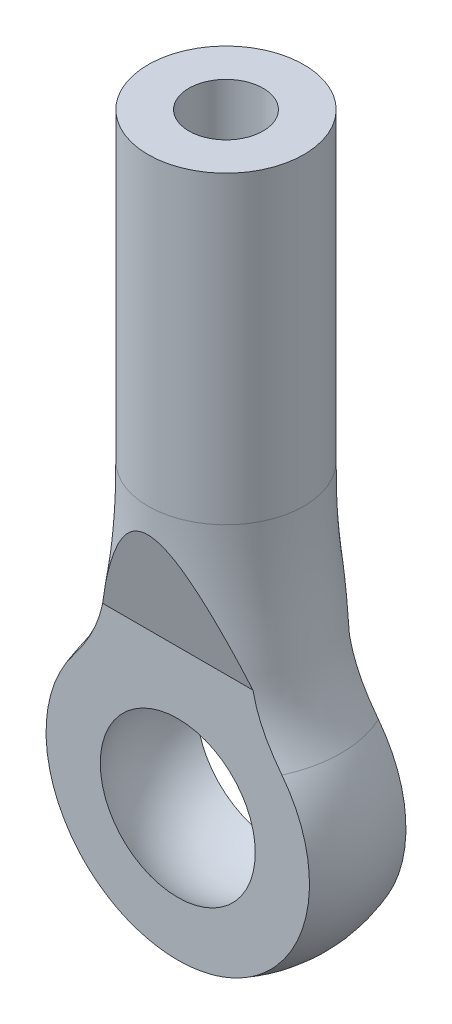
ISO-10303-21;
HEADER;
FILE_DESCRIPTION(('STEP AP214'),'2;1');
FILE_NAME('part.step','',(''),(''),'','','');
FILE_SCHEMA(('AUTOMOTIVE_DESIGN { 1 0 10303 214 1 1 1 1 }'));
ENDSEC;
DATA;
#1=APPLICATION_CONTEXT('core data for automotive mechanical design processes');
#2=APPLICATION_PROTOCOL_DEFINITION('international standard','automotive_design',2000,#1);
#3=PRODUCT_CONTEXT('',#1,'mechanical');
#4=PRODUCT('Part','Part','',(#3));
#5=PRODUCT_RELATED_PRODUCT_CATEGORY('part','',(#4));
#6=PRODUCT_DEFINITION_FORMATION('','',#4);
#7=PRODUCT_DEFINITION_CONTEXT('part definition',#1,'design');
#8=PRODUCT_DEFINITION('design','',#6,#7);
#9=PRODUCT_DEFINITION_SHAPE('','',#8);
#10=(LENGTH_UNIT() NAMED_UNIT(*) SI_UNIT(.MILLI.,.METRE.));
#11=(NAMED_UNIT(*) PLANE_ANGLE_UNIT() SI_UNIT($,.RADIAN.));
#12=(NAMED_UNIT(*) SI_UNIT($,.STERADIAN.) SOLID_ANGLE_UNIT());
#13=UNCERTAINTY_MEASURE_WITH_UNIT(LENGTH_MEASURE(1.E-05),#10,'distance_accuracy_value','');
#14=(GEOMETRIC_REPRESENTATION_CONTEXT(3) GLOBAL_UNCERTAINTY_ASSIGNED_CONTEXT((#13)) GLOBAL_UNIT_ASSIGNED_CONTEXT((#10,
#11,#12)) REPRESENTATION_CONTEXT('',''));
#15=CARTESIAN_POINT('',(0.,0.,0.));
#16=DIRECTION('',(0.,0.,1.));
#17=DIRECTION('',(1.,0.,0.));
#18=AXIS2_PLACEMENT_3D('',#15,#16,#17);
#19=CARTESIAN_POINT('',(-2.1,7.44362624703913,0.));
#20=CARTESIAN_POINT('',(-2.1,6.03895656151775,0.));
#21=CARTESIAN_POINT('',(-2.21604973445166,5.07485484049602,0.));
#22=CARTESIAN_POINT('',(-2.40518566332008,3.74266654853741,0.));
#23=CARTESIAN_POINT('',(-2.50704085467722,3.0077986124755,0.));
#24=CARTESIAN_POINT('',(-3.09395736948081,2.17159567964097,0.));
#25=B_SPLINE_CURVE_WITH_KNOTS('',3,(#19,#20,#21,#22,#23,#24),.UNSPECIFIED.,.F.,.F.,(4,1,1,4),
(0.,0.498932295994101,0.598932295994101,1.),.UNSPECIFIED.);
#26=CARTESIAN_POINT('',(0.,15.65,0.));
#27=DIRECTION('',(0.,1.,0.));
#28=AXIS1_PLACEMENT('',#26,#27);
#29=SURFACE_OF_REVOLUTION('',#25,#28);
#30=CARTESIAN_POINT('',(0.,7.44362624703913,0.));
#31=DIRECTION('',(0.,1.,0.));
#32=DIRECTION('',(0.,0.,1.));
#33=AXIS2_PLACEMENT_3D('',#30,#31,#32);
#34=CIRCLE('',#33,2.1);
#35=CARTESIAN_POINT('',(0.,7.44362624703913,2.1));
#36=VERTEX_POINT('',#35);
#37=EDGE_CURVE('E151',#36,#36,#34,.T.);
#38=ORIENTED_EDGE('',*,*,#37,.F.);
#39=EDGE_LOOP('',(#38));
#40=FACE_BOUND('',#39,.T.);
#41=CARTESIAN_POINT('',(0.,2.17159567964098,0.));
#42=DIRECTION('',(0.,1.,0.));
#43=DIRECTION('',(0.,0.,1.));
#44=AXIS2_PLACEMENT_3D('',#41,#42,#43);
#45=CIRCLE('',#44,3.09395736948081);
#46=CARTESIAN_POINT('',(-2.80759188703854,2.17159567964098,-1.3));
#47=VERTEX_POINT('',#46);
#48=CARTESIAN_POINT('',(-2.80759188703854,2.17159567964098,1.3));
#49=VERTEX_POINT('',#48);
#50=EDGE_CURVE('E154',#47,#49,#45,.T.);
#51=ORIENTED_EDGE('',*,*,#50,.T.);
#52=CARTESIAN_POINT('',(-2.80759188703854,2.17159567964098,1.3));
#53=CARTESIAN_POINT('',(-2.76603533605479,2.22533616025869,1.3));
#54=CARTESIAN_POINT('',(-2.72529979378871,2.27972817876255,1.3));
#55=CARTESIAN_POINT('',(-2.6456773743171,2.39011987369264,1.3));
#56=CARTESIAN_POINT('',(-2.60679704982379,2.44612426807639,1.3));
#57=CARTESIAN_POINT('',(-2.53132956017229,2.55975394060671,1.3));
#58=CARTESIAN_POINT('',(-2.49474495036664,2.61738092503684,1.3));
#59=CARTESIAN_POINT('',(-2.4250396978784,2.73313145961409,1.3));
#60=CARTESIAN_POINT('',(-2.39186433165014,2.79122191818886,1.3));
#61=CARTESIAN_POINT('',(-2.32862780461938,2.90900119058871,1.3));
#62=CARTESIAN_POINT('',(-2.29856335810376,2.96868823247929,1.3));
#63=CARTESIAN_POINT('',(-2.24196229258089,3.08966081644976,1.3));
#64=CARTESIAN_POINT('',(-2.21542270920483,3.15094496282242,1.3));
#65=CARTESIAN_POINT('',(-2.17315408831546,3.25744995847942,1.3));
#66=CARTESIAN_POINT('',(-2.15649252115793,3.30230267520206,1.3));
#67=CARTESIAN_POINT('',(-2.12518136700518,3.3927169290331,1.3));
#68=CARTESIAN_POINT('',(-2.11053220289284,3.43827861289012,1.3));
#69=CARTESIAN_POINT('',(-2.08308794129852,3.53042773208204,1.3));
#70=CARTESIAN_POINT('',(-2.07031191492834,3.57702081008995,1.3));
#71=CARTESIAN_POINT('',(-2.0465810806341,3.6706532046618,1.3));
#72=CARTESIAN_POINT('',(-2.03562565674347,3.71769236458535,1.3));
#73=CARTESIAN_POINT('',(-2.02547550880759,3.76489429954603,1.3));
#74=B_SPLINE_CURVE_WITH_KNOTS('',3,(#52,#53,#54,#55,#56,#57,#58,#59,#60,#61,#62,#63,#64,#65,#66,
#67,#68,#69,#70,#71,#72,#73),.UNSPECIFIED.,.F.,.F.,(4,2,2,2,2,2,2,2,2,2,4),(0.,0.20381267538736,
0.408298751387244,0.613008543998019,0.813616148873261,1.01400966418937,1.21423356911049,
1.35773117631759,1.50125889188708,1.64615922973658,1.79101044303401),.UNSPECIFIED.);
#75=CARTESIAN_POINT('',(-2.02547550880761,3.76489429954604,1.3));
#76=VERTEX_POINT('',#75);
#77=EDGE_CURVE('E57',#49,#76,#74,.T.);
#78=ORIENTED_EDGE('',*,*,#77,.T.);
#79=CARTESIAN_POINT('',(-2.02547550880761,3.76489429954604,1.29999999999998));
#80=CARTESIAN_POINT('',(-2.01472919938393,3.79260971726178,1.30742632379482));
#81=CARTESIAN_POINT('',(-2.00413980048052,3.82038093682993,1.31486759965094));
#82=CARTESIAN_POINT('',(-1.98317438046031,3.8759973201883,1.32976996465775));
#83=CARTESIAN_POINT('',(-1.97279835095873,3.90384248102412,1.33723105301682));
#84=CARTESIAN_POINT('',(-1.95215687729029,3.95957537664327,1.35216463738982));
#85=CARTESIAN_POINT('',(-1.94189144962382,3.98746311708937,1.35963713492108));
#86=CARTESIAN_POINT('',(-1.9213545595363,4.04323675593076,1.37458163640758));
#87=CARTESIAN_POINT('',(-1.91108309708143,4.07112265431473,1.38205364035978));
#88=CARTESIAN_POINT('',(-1.89036325468646,4.12689372178887,1.3969974528505));
#89=CARTESIAN_POINT('',(-1.8799145730759,4.15477878679496,1.40446923349977));
#90=CARTESIAN_POINT('',(-1.85878795126981,4.21046766305372,1.4193910229207));
#91=CARTESIAN_POINT('',(-1.84811001175048,4.23827147454576,1.4268410317565));
#92=CARTESIAN_POINT('',(-1.81576202927882,4.32156459295434,1.44915935556915));
#93=CARTESIAN_POINT('',(-1.79377626258534,4.37693978631886,1.46399709391189));
#94=CARTESIAN_POINT('',(-1.74895532077457,4.48741660569936,1.49359926844725));
#95=CARTESIAN_POINT('',(-1.72611951718857,4.54251799373899,1.5083636408743));
#96=CARTESIAN_POINT('',(-1.67964000091849,4.65240426500099,1.53780757851822));
#97=CARTESIAN_POINT('',(-1.65599624937497,4.70718913285128,1.55248713961615));
#98=CARTESIAN_POINT('',(-1.58397129317403,4.87108612530912,1.59640320638712));
#99=CARTESIAN_POINT('',(-1.53449229236371,4.97975066972032,1.62551978330799));
#100=CARTESIAN_POINT('',(-1.43252891195563,5.19569180891984,1.68338103716917));
#101=CARTESIAN_POINT('',(-1.38004600431121,5.30296905243961,1.71212588793654));
#102=CARTESIAN_POINT('',(-1.2712175619567,5.5156388630616,1.76911059194714));
#103=CARTESIAN_POINT('',(-1.21487417141438,5.62103243601789,1.79735071470815));
#104=CARTESIAN_POINT('',(-1.13438796583178,5.76247074435472,1.83524899520587));
#105=CARTESIAN_POINT('',(-1.11266980176968,5.79980379414049,1.84525235574699));
#106=CARTESIAN_POINT('',(-1.06838141887941,5.8739980627223,1.86513265009651));
#107=CARTESIAN_POINT('',(-1.04581118113883,5.91085927102112,1.87500958109221));
#108=CARTESIAN_POINT('',(-0.999615783694389,5.984112332268,1.89463767969642));
#109=CARTESIAN_POINT('',(-0.975987680973321,6.02050245935769,1.90438838486257));
#110=CARTESIAN_POINT('',(-0.927571293651027,6.09255589301128,1.92369504422194));
#111=CARTESIAN_POINT('',(-0.902783054023135,6.12821922767287,1.93325100594391));
#112=CARTESIAN_POINT('',(-0.849000417840321,6.20255496400817,1.95316920646372));
#113=CARTESIAN_POINT('',(-0.819845194940028,6.24111955144347,1.96350255652345));
#114=CARTESIAN_POINT('',(-0.759505698485368,6.31673547258002,1.98376378152693));
#115=CARTESIAN_POINT('',(-0.728321940479127,6.35378718690872,1.99369175845949));
#116=CARTESIAN_POINT('',(-0.663597997804945,6.4257090996818,2.01296317690514));
#117=CARTESIAN_POINT('',(-0.630066539161551,6.46058655152825,2.02230856196147));
#118=CARTESIAN_POINT('',(-0.560063019663715,6.52743975271063,2.04022182322969));
#119=CARTESIAN_POINT('',(-0.523594522768085,6.55941892169286,2.04879061573305));
#120=CARTESIAN_POINT('',(-0.452377700213506,6.61511364433955,2.06371397168891));
#121=CARTESIAN_POINT('',(-0.418081541483814,6.63936088926314,2.0702110013849));
#122=CARTESIAN_POINT('',(-0.34655108999227,6.6835431769631,2.0820496096939));
#123=CARTESIAN_POINT('',(-0.309315897607924,6.70347689235065,2.08739083263414));
#124=CARTESIAN_POINT('',(-0.23137486960084,6.73761479520915,2.09653805613635));
#125=CARTESIAN_POINT('',(-0.190626085600232,6.75173051472743,2.10032035178186));
#126=CARTESIAN_POINT('',(-0.1070634500384,6.77186159678394,2.10571445896167));
#127=CARTESIAN_POINT('',(-0.0642558448598268,6.77790003524048,2.10733245366965));
#128=CARTESIAN_POINT('',(0.0161050003784142,6.7806820015555,2.10807787929712));
#129=CARTESIAN_POINT('',(0.0536191598586208,6.77853010531929,2.10750128043844));
#130=CARTESIAN_POINT('',(0.127631833235744,6.76766260810308,2.10458934333561));
#131=CARTESIAN_POINT('',(0.16412882564231,6.75893766979107,2.10225150316089));
#132=CARTESIAN_POINT('',(0.243975046234401,6.73311629949848,2.09533268784353));
#133=CARTESIAN_POINT('',(0.286779089150887,6.71448041726543,2.09033921824894));
#134=CARTESIAN_POINT('',(0.368824735251603,6.67100159350336,2.07868910253404));
#135=CARTESIAN_POINT('',(0.408059289441349,6.64614671865215,2.07202925888968));
#136=CARTESIAN_POINT('',(0.480121149795293,6.59434220616367,2.0581482816041));
#137=CARTESIAN_POINT('',(0.513210016595784,6.56772440209631,2.05101606249997));
#138=CARTESIAN_POINT('',(0.576943580728,6.51186153796875,2.0360476531701));
#139=CARTESIAN_POINT('',(0.607585918901388,6.48261399850005,2.02821079858886));
#140=CARTESIAN_POINT('',(0.666867347354748,6.42211037388877,2.01199890123512));
#141=CARTESIAN_POINT('',(0.695499166167031,6.39084771101949,2.00362209596605));
#142=CARTESIAN_POINT('',(0.750959833340318,6.32690348068237,1.98648829108658));
#143=CARTESIAN_POINT('',(0.777789614098387,6.29422266162211,1.9777314920114));
#144=CARTESIAN_POINT('',(0.836950294963602,6.21883583032201,1.95753165144459));
#145=CARTESIAN_POINT('',(0.868822548919816,6.17579533593933,1.94599898573292));
#146=CARTESIAN_POINT('',(0.9306002236605,6.08841122706606,1.92258448432902));
#147=CARTESIAN_POINT('',(0.960505074184557,6.04406724009419,1.91070254883073));
#148=CARTESIAN_POINT('',(1.04792805577868,5.90940214357182,1.8746191449689));
#149=CARTESIAN_POINT('',(1.10302615440085,5.81761838690391,1.85002576149144));
#150=CARTESIAN_POINT('',(1.20883467020701,5.63160992400622,1.80018494407265));
#151=CARTESIAN_POINT('',(1.25953905432139,5.5373820852829,1.77493667078221));
#152=CARTESIAN_POINT('',(1.35789151614781,5.34702457494129,1.72393052961297));
#153=CARTESIAN_POINT('',(1.40552768264547,5.25088918863501,1.69817113048815));
#154=CARTESIAN_POINT('',(1.49817697683666,5.05763522171307,1.64638888611732));
#155=CARTESIAN_POINT('',(1.5431940789308,4.96051840799946,1.62036651431129));
#156=CARTESIAN_POINT('',(1.6309012805981,4.76535878356269,1.56807365054825));
#157=CARTESIAN_POINT('',(1.67359241769767,4.66731640897886,1.54180327545442));
#158=CARTESIAN_POINT('',(1.74290763493185,4.50224791069276,1.49757330464287));
#159=CARTESIAN_POINT('',(1.77024328484287,4.43549995388593,1.4796882435201));
#160=CARTESIAN_POINT('',(1.82372028796729,4.30153200034363,1.44379163855682));
#161=CARTESIAN_POINT('',(1.84986124548686,4.23431185559849,1.42578005505725));
#162=CARTESIAN_POINT('',(1.90058328731816,4.09992818493776,1.38977205902776));
#163=CARTESIAN_POINT('',(1.92517504062805,4.03276838721359,1.37177664546374));
#164=CARTESIAN_POINT('',(1.9746725514105,3.89858844070454,1.33582323715619));
#165=CARTESIAN_POINT('',(1.99957817971307,3.83156824690008,1.31786523034972));
#166=CARTESIAN_POINT('',(2.02547550880759,3.76489429954604,1.3));
#167=B_SPLINE_CURVE_WITH_KNOTS('',3,(#79,#80,#81,#82,#83,#84,#85,#86,#87,#88,#89,#90,#91,#92,
#93,#94,#95,#96,#97,#98,#99,#100,#101,#102,#103,#104,#105,#106,#107,#108,#109,#110,#111,#112,
#113,#114,#115,#116,#117,#118,#119,#120,#121,#122,#123,#124,#125,#126,#127,#128,#129,#130,#131,
#132,#133,#134,#135,#136,#137,#138,#139,#140,#141,#142,#143,#144,#145,#146,#147,#148,#149,#150,
#151,#152,#153,#154,#155,#156,#157,#158,#159,#160,#161,#162,#163,#164,#165,#166),.UNSPECIFIED.,
.F.,.F.,(4,2,2,2,2,2,2,2,2,2,2,2,2,2,2,2,2,2,2,2,2,2,2,2,2,2,2,2,2,2,2,2,2,2,2,2,2,2,2,2,2,2,2,
4),(0.,0.0919166970375345,0.183829775097579,0.275756380676258,0.367683506338222,
0.459787034206494,0.551890290450065,0.736082938542771,0.920414583889697,1.10475510745127,
1.47340267610138,1.84187112398768,2.21013655267782,2.3431300699895,2.47612654092702,
2.60951930991821,2.74290691214304,2.89116587528165,3.03938730481079,3.18708440479408,
3.33460490624588,3.46185540741237,3.58914501146276,3.71830449112005,3.84709418236243,
3.95916976561301,4.07140485869722,4.21147254606894,4.35181109179894,4.48080320690777,
4.60991824189319,4.73947846384392,4.86897112490679,5.03325403539985,5.19758435609735,
5.52689825704362,5.85665740564653,6.18762788960256,6.51808227529194,6.84838803003464,
7.07131692943085,7.29431913774933,7.5155640101121,7.73672062744916),.UNSPECIFIED.);
#168=CARTESIAN_POINT('',(2.0254755088076,3.76489429954604,1.3));
#169=VERTEX_POINT('',#168);
#170=EDGE_CURVE('E11',#76,#169,#167,.T.);
#171=ORIENTED_EDGE('',*,*,#170,.T.);
#172=CARTESIAN_POINT('',(2.0254755088076,3.76489429954604,1.3));
#173=CARTESIAN_POINT('',(2.03285741030641,3.7306319224151,1.3));
#174=CARTESIAN_POINT('',(2.04064698579813,3.69645655447712,1.3));
#175=CARTESIAN_POINT('',(2.0571482940166,3.62832406137667,1.3));
#176=CARTESIAN_POINT('',(2.06586017047194,3.59436697110711,1.3));
#177=CARTESIAN_POINT('',(2.09349667205432,3.493049273447,1.3));
#178=CARTESIAN_POINT('',(2.11395266877168,3.42609613445667,1.3));
#179=CARTESIAN_POINT('',(2.15918622556807,3.29373239597974,1.3));
#180=CARTESIAN_POINT('',(2.18396002079511,3.22832050856196,1.3));
#181=CARTESIAN_POINT('',(2.23720243780141,3.10025717369021,1.3));
#182=CARTESIAN_POINT('',(2.26560515853897,3.0375782396286,1.3));
#183=CARTESIAN_POINT('',(2.32600534084087,2.91395874258736,1.3));
#184=CARTESIAN_POINT('',(2.35800407463154,2.85301880446538,1.3));
#185=CARTESIAN_POINT('',(2.42510805104454,2.73288873572571,1.3));
#186=CARTESIAN_POINT('',(2.46021299648867,2.67369843843726,1.3));
#187=CARTESIAN_POINT('',(2.52047769739118,2.57715678534395,1.3));
#188=CARTESIAN_POINT('',(2.54488060843219,2.53932886114266,1.3));
#189=CARTESIAN_POINT('',(2.59469872267371,2.46436265811927,1.3));
#190=CARTESIAN_POINT('',(2.62011360306784,2.42722416483222,1.3));
#191=CARTESIAN_POINT('',(2.67205187698599,2.35331319065545,1.3));
#192=CARTESIAN_POINT('',(2.69858218307727,2.3165455799306,1.3));
#193=CARTESIAN_POINT('',(2.75248186480007,2.24362054297867,1.3));
#194=CARTESIAN_POINT('',(2.77985138139571,2.20746322086222,1.3));
#195=CARTESIAN_POINT('',(2.80759188703854,2.17159567964097,1.3));
#196=B_SPLINE_CURVE_WITH_KNOTS('',3,(#172,#173,#174,#175,#176,#177,#178,#179,#180,#181,#182,
#183,#184,#185,#186,#187,#188,#189,#190,#191,#192,#193,#194,#195),.UNSPECIFIED.,.F.,.F.,(4,2,2,
2,2,2,2,2,2,2,2,4),(0.,0.105143185425292,0.210302780232568,0.420174894751286,0.6298649210553,
0.836179277793185,1.04256685724303,1.24893471243898,1.38396757361638,1.51895770064728,
1.65496551455101,1.79099630051916),.UNSPECIFIED.);
#197=CARTESIAN_POINT('',(2.80759188703854,2.17159567964098,1.3));
#198=VERTEX_POINT('',#197);
#199=EDGE_CURVE('E101',#169,#198,#196,.T.);
#200=ORIENTED_EDGE('',*,*,#199,.T.);
#201=CARTESIAN_POINT('',(2.80759188703854,2.17159567964098,-1.3));
#202=VERTEX_POINT('',#201);
#203=EDGE_CURVE('E100',#198,#202,#45,.T.);
#204=ORIENTED_EDGE('',*,*,#203,.T.);
#205=CARTESIAN_POINT('',(2.80759188703854,2.17159567964098,-1.3));
#206=CARTESIAN_POINT('',(2.76603533605479,2.22533616025869,-1.3));
#207=CARTESIAN_POINT('',(2.72529979378871,2.27972817876254,-1.3));
#208=CARTESIAN_POINT('',(2.6456773743171,2.39011987369264,-1.3));
#209=CARTESIAN_POINT('',(2.60679704982379,2.44612426807639,-1.3));
#210=CARTESIAN_POINT('',(2.53132956017229,2.55975394060671,-1.3));
#211=CARTESIAN_POINT('',(2.49474495036664,2.61738092503684,-1.3));
#212=CARTESIAN_POINT('',(2.4250396978784,2.73313145961409,-1.3));
#213=CARTESIAN_POINT('',(2.39186433165014,2.79122191818886,-1.3));
#214=CARTESIAN_POINT('',(2.32862780461938,2.90900119058871,-1.3));
#215=CARTESIAN_POINT('',(2.29856335810376,2.96868823247929,-1.3));
#216=CARTESIAN_POINT('',(2.24196229258089,3.08966081644976,-1.3));
#217=CARTESIAN_POINT('',(2.21542270920483,3.15094496282242,-1.3));
#218=CARTESIAN_POINT('',(2.17315408831546,3.25744995847942,-1.3));
#219=CARTESIAN_POINT('',(2.15649252115793,3.30230267520206,-1.3));
#220=CARTESIAN_POINT('',(2.12518136700518,3.3927169290331,-1.3));
#221=CARTESIAN_POINT('',(2.11053220289284,3.43827861289011,-1.3));
#222=CARTESIAN_POINT('',(2.08308794129852,3.53042773208204,-1.3));
#223=CARTESIAN_POINT('',(2.07031191492834,3.57702081008995,-1.3));
#224=CARTESIAN_POINT('',(2.0465810806341,3.6706532046618,-1.3));
#225=CARTESIAN_POINT('',(2.03562565674347,3.71769236458535,-1.3));
#226=CARTESIAN_POINT('',(2.02547550880759,3.76489429954603,-1.3));
#227=B_SPLINE_CURVE_WITH_KNOTS('',3,(#205,#206,#207,#208,#209,#210,#211,#212,#213,#214,#215,
#216,#217,#218,#219,#220,#221,#222,#223,#224,#225,#226),.UNSPECIFIED.,.F.,.F.,(4,2,2,2,2,2,2,2,
2,2,4),(0.,0.20381267538736,0.408298751387244,0.613008543998018,0.813616148873259,
1.01400966418937,1.21423356911049,1.35773117631759,1.50125889188708,1.64615922973657,
1.79101044303401),.UNSPECIFIED.);
#228=CARTESIAN_POINT('',(2.02547550880761,3.76489429954604,-1.3));
#229=VERTEX_POINT('',#228);
#230=EDGE_CURVE('E65',#202,#229,#227,.T.);
#231=ORIENTED_EDGE('',*,*,#230,.T.);
#232=CARTESIAN_POINT('',(2.02547550880761,3.76489429954604,-1.29999999999998));
#233=CARTESIAN_POINT('',(2.01472919938393,3.79260971726178,-1.30742632379482));
#234=CARTESIAN_POINT('',(2.00413980048052,3.82038093682993,-1.31486759965093));
#235=CARTESIAN_POINT('',(1.98317438046031,3.8759973201883,-1.32976996465775));
#236=CARTESIAN_POINT('',(1.97279835095873,3.90384248102411,-1.33723105301682));
#237=CARTESIAN_POINT('',(1.95215687729029,3.95957537664327,-1.35216463738982));
#238=CARTESIAN_POINT('',(1.94189144962382,3.98746311708937,-1.35963713492108));
#239=CARTESIAN_POINT('',(1.9213545595363,4.04323675593076,-1.37458163640758));
#240=CARTESIAN_POINT('',(1.91108309708143,4.07112265431473,-1.38205364035978));
#241=CARTESIAN_POINT('',(1.89036325468647,4.12689372178886,-1.39699745285049));
#242=CARTESIAN_POINT('',(1.8799145730759,4.15477878679496,-1.40446923349977));
#243=CARTESIAN_POINT('',(1.85878795126981,4.21046766305371,-1.4193910229207));
#244=CARTESIAN_POINT('',(1.84811001175048,4.23827147454575,-1.4268410317565));
#245=CARTESIAN_POINT('',(1.81576202927882,4.32156459295434,-1.44915935556915));
#246=CARTESIAN_POINT('',(1.79377626258534,4.37693978631885,-1.46399709391188));
#247=CARTESIAN_POINT('',(1.74895532077458,4.48741660569936,-1.49359926844725));
#248=CARTESIAN_POINT('',(1.72611951718857,4.54251799373899,-1.5083636408743));
#249=CARTESIAN_POINT('',(1.67964000091849,4.65240426500098,-1.53780757851822));
#250=CARTESIAN_POINT('',(1.65599624937498,4.70718913285127,-1.55248713961615));
#251=CARTESIAN_POINT('',(1.58397129317404,4.87108612530911,-1.59640320638711));
#252=CARTESIAN_POINT('',(1.53449229236371,4.97975066972031,-1.62551978330799));
#253=CARTESIAN_POINT('',(1.43252891195563,5.19569180891982,-1.68338103716916));
#254=CARTESIAN_POINT('',(1.38004600431121,5.30296905243959,-1.71212588793654));
#255=CARTESIAN_POINT('',(1.27121756195671,5.51563886306159,-1.76911059194714));
#256=CARTESIAN_POINT('',(1.21487417141439,5.62103243601788,-1.79735071470815));
#257=CARTESIAN_POINT('',(1.13438796583179,5.7624707443547,-1.83524899520587));
#258=CARTESIAN_POINT('',(1.11266980176969,5.79980379414047,-1.84525235574698));
#259=CARTESIAN_POINT('',(1.06838141887942,5.87399806272228,-1.86513265009651));
#260=CARTESIAN_POINT('',(1.04581118113884,5.9108592710211,-1.87500958109221));
#261=CARTESIAN_POINT('',(0.999615783694402,5.98411233226799,-1.89463767969641));
#262=CARTESIAN_POINT('',(0.975987680973332,6.02050245935767,-1.90438838486256));
#263=CARTESIAN_POINT('',(0.927571293651038,6.09255589301126,-1.92369504422193));
#264=CARTESIAN_POINT('',(0.902783054023145,6.12821922767285,-1.93325100594391));
#265=CARTESIAN_POINT('',(0.849000417840332,6.20255496400815,-1.95316920646372));
#266=CARTESIAN_POINT('',(0.819845194940039,6.24111955144345,-1.96350255652345));
#267=CARTESIAN_POINT('',(0.759505698485379,6.31673547258001,-1.98376378152692));
#268=CARTESIAN_POINT('',(0.72832194047914,6.35378718690871,-1.99369175845948));
#269=CARTESIAN_POINT('',(0.663597997804959,6.42570909968179,-2.01296317690514));
#270=CARTESIAN_POINT('',(0.630066539161566,6.46058655152823,-2.02230856196146));
#271=CARTESIAN_POINT('',(0.560063019663729,6.52743975271062,-2.04022182322968));
#272=CARTESIAN_POINT('',(0.523594522768099,6.55941892169285,-2.04879061573304));
#273=CARTESIAN_POINT('',(0.452377700213518,6.61511364433954,-2.0637139716889));
#274=CARTESIAN_POINT('',(0.418081541483826,6.63936088926313,-2.0702110013849));
#275=CARTESIAN_POINT('',(0.346551089992281,6.6835431769631,-2.0820496096939));
#276=CARTESIAN_POINT('',(0.309315897607936,6.70347689235065,-2.08739083263413));
#277=CARTESIAN_POINT('',(0.23137486960085,6.73761479520915,-2.09653805613635));
#278=CARTESIAN_POINT('',(0.190626085600241,6.75173051472743,-2.10032035178186));
#279=CARTESIAN_POINT('',(0.107063450038408,6.77186159678394,-2.10571445896167));
#280=CARTESIAN_POINT('',(0.0642558448598338,6.77790003524048,-2.10733245366965));
#281=CARTESIAN_POINT('',(-0.0161050003784085,6.7806820015555,-2.10807787929712));
#282=CARTESIAN_POINT('',(-0.0536191598586158,6.7785301053193,-2.10750128043844));
#283=CARTESIAN_POINT('',(-0.12763183323574,6.76766260810308,-2.10458934333561));
#284=CARTESIAN_POINT('',(-0.164128825642305,6.75893766979108,-2.10225150316089));
#285=CARTESIAN_POINT('',(-0.243975046234396,6.73311629949848,-2.09533268784353));
#286=CARTESIAN_POINT('',(-0.286779089150881,6.71448041726543,-2.09033921824894));
#287=CARTESIAN_POINT('',(-0.368824735251596,6.67100159350337,-2.07868910253404));
#288=CARTESIAN_POINT('',(-0.408059289441343,6.64614671865216,-2.07202925888968));
#289=CARTESIAN_POINT('',(-0.480121149795287,6.59434220616367,-2.05814828160411));
#290=CARTESIAN_POINT('',(-0.513210016595777,6.56772440209631,-2.05101606249997));
#291=CARTESIAN_POINT('',(-0.576943580727992,6.51186153796875,-2.0360476531701));
#292=CARTESIAN_POINT('',(-0.60758591890138,6.48261399850005,-2.02821079858886));
#293=CARTESIAN_POINT('',(-0.666867347354741,6.42211037388878,-2.01199890123512));
#294=CARTESIAN_POINT('',(-0.695499166167024,6.3908477110195,-2.00362209596605));
#295=CARTESIAN_POINT('',(-0.75095983334031,6.32690348068237,-1.98648829108658));
#296=CARTESIAN_POINT('',(-0.777789614098379,6.29422266162212,-1.9777314920114));
#297=CARTESIAN_POINT('',(-0.836950294963595,6.21883583032201,-1.9575316514446));
#298=CARTESIAN_POINT('',(-0.86882254891981,6.17579533593934,-1.94599898573292));
#299=CARTESIAN_POINT('',(-0.930600223660494,6.08841122706607,-1.92258448432902));
#300=CARTESIAN_POINT('',(-0.960505074184548,6.0440672400942,-1.91070254883073));
#301=CARTESIAN_POINT('',(-1.04792805577867,5.90940214357183,-1.87461914496891));
#302=CARTESIAN_POINT('',(-1.10302615440084,5.81761838690393,-1.85002576149144));
#303=CARTESIAN_POINT('',(-1.20883467020699,5.63160992400624,-1.80018494407266));
#304=CARTESIAN_POINT('',(-1.25953905432137,5.53738208528292,-1.77493667078222));
#305=CARTESIAN_POINT('',(-1.3578915161478,5.34702457494132,-1.72393052961298));
#306=CARTESIAN_POINT('',(-1.40552768264545,5.25088918863504,-1.69817113048816));
#307=CARTESIAN_POINT('',(-1.49817697683664,5.05763522171311,-1.64638888611733));
#308=CARTESIAN_POINT('',(-1.54319407893078,4.9605184079995,-1.6203665143113));
#309=CARTESIAN_POINT('',(-1.63090128059807,4.76535878356274,-1.56807365054826));
#310=CARTESIAN_POINT('',(-1.67359241769765,4.66731640897891,-1.54180327545443));
#311=CARTESIAN_POINT('',(-1.74290763493183,4.50224791069281,-1.49757330464288));
#312=CARTESIAN_POINT('',(-1.77024328484285,4.43549995388598,-1.47968824352011));
#313=CARTESIAN_POINT('',(-1.82372028796728,4.30153200034366,-1.44379163855683));
#314=CARTESIAN_POINT('',(-1.84986124548685,4.23431185559852,-1.42578005505725));
#315=CARTESIAN_POINT('',(-1.90058328731815,4.09992818493778,-1.38977205902777));
#316=CARTESIAN_POINT('',(-1.92517504062804,4.0327683872136,-1.37177664546374));
#317=CARTESIAN_POINT('',(-1.9746725514105,3.89858844070455,-1.3358232371562));
#318=CARTESIAN_POINT('',(-1.99957817971307,3.83156824690009,-1.31786523034972));
#319=CARTESIAN_POINT('',(-2.02547550880759,3.76489429954604,-1.3));
#320=B_SPLINE_CURVE_WITH_KNOTS('',3,(#232,#233,#234,#235,#236,#237,#238,#239,#240,#241,#242,
#243,#244,#245,#246,#247,#248,#249,#250,#251,#252,#253,#254,#255,#256,#257,#258,#259,#260,#261,
#262,#263,#264,#265,#266,#267,#268,#269,#270,#271,#272,#273,#274,#275,#276,#277,#278,#279,#280,
#281,#282,#283,#284,#285,#286,#287,#288,#289,#290,#291,#292,#293,#294,#295,#296,#297,#298,#299,
#300,#301,#302,#303,#304,#305,#306,#307,#308,#309,#310,#311,#312,#313,#314,#315,#316,#317,#318,
#319),.UNSPECIFIED.,.F.,.F.,(4,2,2,2,2,2,2,2,2,2,2,2,2,2,2,2,2,2,2,2,2,2,2,2,2,2,2,2,2,2,2,2,2,
2,2,2,2,2,2,2,2,2,2,4),(0.,0.0919166970375326,0.183829775097576,0.275756380676255,
0.367683506338217,0.45978703420649,0.551890290450059,0.736082938542764,0.920414583889688,
1.10475510745125,1.47340267610137,1.84187112398766,2.21013655267779,2.34313006998948,
2.476126540927,2.60951930991819,2.74290691214302,2.89116587528163,3.03938730481077,
3.18708440479406,3.33460490624586,3.46185540741236,3.58914501146274,3.71830449112005,
3.84709418236242,3.959169765613,4.07140485869722,4.21147254606893,4.35181109179893,
4.48080320690776,4.60991824189318,4.73947846384391,4.86897112490678,5.03325403539984,
5.19758435609733,5.52689825704359,5.8566574056465,6.18762788960252,6.51808227529189,
6.84838803003458,7.07131692943081,7.2943191377493,7.51556401011209,7.73672062744916),.UNSPECIFIED.);
#321=CARTESIAN_POINT('',(-2.0254755088076,3.76489429954604,-1.3));
#322=VERTEX_POINT('',#321);
#323=EDGE_CURVE('E50',#229,#322,#320,.T.);
#324=ORIENTED_EDGE('',*,*,#323,.T.);
#325=CARTESIAN_POINT('',(-2.0254755088076,3.76489429954604,-1.29999999999999));
#326=CARTESIAN_POINT('',(-2.03285741030641,3.7306319224151,-1.3));
#327=CARTESIAN_POINT('',(-2.04064698579813,3.69645655447712,-1.3));
#328=CARTESIAN_POINT('',(-2.0571482940166,3.62832406137667,-1.3));
#329=CARTESIAN_POINT('',(-2.06586017047194,3.59436697110711,-1.3));
#330=CARTESIAN_POINT('',(-2.09349667205433,3.493049273447,-1.3));
#331=CARTESIAN_POINT('',(-2.11395266877168,3.42609613445667,-1.3));
#332=CARTESIAN_POINT('',(-2.15918622556807,3.29373239597974,-1.3));
#333=CARTESIAN_POINT('',(-2.18396002079512,3.22832050856196,-1.3));
#334=CARTESIAN_POINT('',(-2.23720243780141,3.10025717369021,-1.3));
#335=CARTESIAN_POINT('',(-2.26560515853897,3.0375782396286,-1.3));
#336=CARTESIAN_POINT('',(-2.32600534084087,2.91395874258736,-1.3));
#337=CARTESIAN_POINT('',(-2.35800407463154,2.85301880446538,-1.3));
#338=CARTESIAN_POINT('',(-2.42510805104454,2.73288873572571,-1.3));
#339=CARTESIAN_POINT('',(-2.46021299648868,2.67369843843726,-1.3));
#340=CARTESIAN_POINT('',(-2.52047769739118,2.57715678534395,-1.3));
#341=CARTESIAN_POINT('',(-2.54488060843219,2.53932886114266,-1.3));
#342=CARTESIAN_POINT('',(-2.59469872267371,2.46436265811927,-1.3));
#343=CARTESIAN_POINT('',(-2.62011360306784,2.42722416483222,-1.3));
#344=CARTESIAN_POINT('',(-2.67205187698599,2.35331319065545,-1.3));
#345=CARTESIAN_POINT('',(-2.69858218307727,2.31654557993059,-1.3));
#346=CARTESIAN_POINT('',(-2.75248186480007,2.24362054297867,-1.3));
#347=CARTESIAN_POINT('',(-2.77985138139571,2.20746322086222,-1.3));
#348=CARTESIAN_POINT('',(-2.80759188703854,2.17159567964097,-1.3));
#349=B_SPLINE_CURVE_WITH_KNOTS('',3,(#325,#326,#327,#328,#329,#330,#331,#332,#333,#334,#335,
#336,#337,#338,#339,#340,#341,#342,#343,#344,#345,#346,#347,#348),.UNSPECIFIED.,.F.,.F.,(4,2,2,
2,2,2,2,2,2,2,2,4),(0.,0.105143185425292,0.210302780232568,0.420174894751287,0.629864921055301,
0.836179277793186,1.04256685724303,1.24893471243898,1.38396757361638,1.51895770064728,
1.65496551455101,1.79099630051916),.UNSPECIFIED.);
#350=EDGE_CURVE('E92',#322,#47,#349,.T.);
#351=ORIENTED_EDGE('',*,*,#350,.T.);
#352=EDGE_LOOP('',(#51,#78,#171,#200,#204,#231,#324,#351));
#353=FACE_BOUND('',#352,.T.);
#354=ADVANCED_FACE('F41',(#40,#353),#29,.F.);
#355=CARTESIAN_POINT('',(0.,0.,0.));
#356=DIRECTION('',(0.,1.,0.));
#357=DIRECTION('',(-1.,0.,0.));
#358=AXIS2_PLACEMENT_3D('',#355,#356,#357);
#359=SPHERICAL_SURFACE('',#358,3.78);
#360=ORIENTED_EDGE('',*,*,#203,.F.);
#361=CARTESIAN_POINT('',(0.,0.,1.3));
#362=DIRECTION('',(0.,0.,1.));
#363=DIRECTION('',(0.,-1.,0.));
#364=AXIS2_PLACEMENT_3D('',#361,#362,#363);
#365=CIRCLE('',#364,3.54942248823664);
#366=EDGE_CURVE('E89',#198,#49,#365,.F.);
#367=ORIENTED_EDGE('',*,*,#366,.T.);
#368=ORIENTED_EDGE('',*,*,#50,.F.);
#369=CARTESIAN_POINT('',(0.,0.,-1.3));
#370=DIRECTION('',(0.,0.,-1.));
#371=DIRECTION('',(0.,1.,0.));
#372=AXIS2_PLACEMENT_3D('',#369,#370,#371);
#373=CIRCLE('',#372,3.54942248823664);
#374=EDGE_CURVE('E146',#47,#202,#373,.F.);
#375=ORIENTED_EDGE('',*,*,#374,.T.);
#376=EDGE_LOOP('',(#360,#367,#368,#375));
#377=FACE_BOUND('',#376,.T.);
#378=ADVANCED_FACE('F135',(#377),#359,.T.);
#379=CARTESIAN_POINT('',(0.,15.65,0.));
#380=DIRECTION('',(0.,1.,0.));
#381=DIRECTION('',(0.,0.,1.));
#382=AXIS2_PLACEMENT_3D('',#379,#380,#381);
#383=PLANE('',#382);
#384=CARTESIAN_POINT('',(0.,15.65,0.));
#385=DIRECTION('',(0.,1.,0.));
#386=DIRECTION('',(0.,0.,1.));
#387=AXIS2_PLACEMENT_3D('',#384,#385,#386);
#388=CIRCLE('',#387,1.);
#389=CARTESIAN_POINT('',(0.,15.65,1.));
#390=VERTEX_POINT('',#389);
#391=EDGE_CURVE('E203',#390,#390,#388,.T.);
#392=ORIENTED_EDGE('',*,*,#391,.F.);
#393=EDGE_LOOP('',(#392));
#394=FACE_BOUND('',#393,.T.);
#395=CARTESIAN_POINT('',(0.,15.65,0.));
#396=DIRECTION('',(0.,1.,0.));
#397=DIRECTION('',(0.,0.,1.));
#398=AXIS2_PLACEMENT_3D('',#395,#396,#397);
#399=CIRCLE('',#398,2.1);
#400=CARTESIAN_POINT('',(0.,15.65,2.1));
#401=VERTEX_POINT('',#400);
#402=EDGE_CURVE('E148',#401,#401,#399,.T.);
#403=ORIENTED_EDGE('',*,*,#402,.T.);
#404=EDGE_LOOP('',(#403));
#405=FACE_BOUND('',#404,.T.);
#406=ADVANCED_FACE('F43',(#394,#405),#383,.T.);
#407=CARTESIAN_POINT('',(0.,15.65,0.));
#408=DIRECTION('',(0.,1.,0.));
#409=DIRECTION('',(0.,0.,1.));
#410=AXIS2_PLACEMENT_3D('',#407,#408,#409);
#411=CYLINDRICAL_SURFACE('',#410,2.1);
#412=ORIENTED_EDGE('',*,*,#37,.T.);
#413=EDGE_LOOP('',(#412));
#414=FACE_BOUND('',#413,.T.);
#415=ORIENTED_EDGE('',*,*,#402,.F.);
#416=EDGE_LOOP('',(#415));
#417=FACE_BOUND('',#416,.T.);
#418=ADVANCED_FACE('F128',(#414,#417),#411,.T.);
#419=CARTESIAN_POINT('',(10.,3.76489429954604,-1.3));
#420=DIRECTION('',(0.,0.,-1.));
#421=DIRECTION('',(0.,1.,0.));
#422=AXIS2_PLACEMENT_3D('',#419,#420,#421);
#423=PLANE('',#422);
#424=CARTESIAN_POINT('',(0.,0.,-1.3));
#425=DIRECTION('',(0.,0.,-1.));
#426=DIRECTION('',(0.,1.,0.));
#427=AXIS2_PLACEMENT_3D('',#424,#425,#426);
#428=CIRCLE('',#427,2.08844439715306);
#429=CARTESIAN_POINT('',(0.,2.08844439715306,-1.3));
#430=VERTEX_POINT('',#429);
#431=EDGE_CURVE('E94',#430,#430,#428,.F.);
#432=ORIENTED_EDGE('',*,*,#431,.T.);
#433=EDGE_LOOP('',(#432));
#434=FACE_BOUND('',#433,.T.);
#435=ORIENTED_EDGE('',*,*,#374,.F.);
#436=ORIENTED_EDGE('',*,*,#350,.F.);
#437=DIRECTION('',(-1.,0.,0.));
#438=VECTOR('',#437,1.);
#439=CARTESIAN_POINT('',(10.,3.76489429954604,-1.3));
#440=LINE('',#439,#438);
#441=EDGE_CURVE('E86',#229,#322,#440,.T.);
#442=ORIENTED_EDGE('',*,*,#441,.F.);
#443=ORIENTED_EDGE('',*,*,#230,.F.);
#444=EDGE_LOOP('',(#435,#436,#442,#443));
#445=FACE_BOUND('',#444,.T.);
#446=ADVANCED_FACE('F91',(#434,#445),#423,.T.);
#447=CARTESIAN_POINT('',(10.,3.76489429954604,-1.3));
#448=DIRECTION('',(0.,-0.258819045102515,-0.96592582628907));
#449=DIRECTION('',(0.,0.96592582628907,-0.258819045102515));
#450=AXIS2_PLACEMENT_3D('',#447,#448,#449);
#451=PLANE('',#450);
#452=ORIENTED_EDGE('',*,*,#441,.T.);
#453=ORIENTED_EDGE('',*,*,#323,.F.);
#454=EDGE_LOOP('',(#452,#453));
#455=FACE_BOUND('',#454,.T.);
#456=ADVANCED_FACE('F85',(#455),#451,.T.);
#457=CARTESIAN_POINT('',(10.,3.76489429954604,1.3));
#458=DIRECTION('',(0.,-0.258819045102515,0.96592582628907));
#459=DIRECTION('',(0.,-0.96592582628907,-0.258819045102515));
#460=AXIS2_PLACEMENT_3D('',#457,#458,#459);
#461=PLANE('',#460);
#462=DIRECTION('',(-1.,0.,0.));
#463=VECTOR('',#462,1.);
#464=CARTESIAN_POINT('',(10.,3.76489429954604,1.3));
#465=LINE('',#464,#463);
#466=EDGE_CURVE('E93',#169,#76,#465,.T.);
#467=ORIENTED_EDGE('',*,*,#466,.F.);
#468=ORIENTED_EDGE('',*,*,#170,.F.);
#469=EDGE_LOOP('',(#467,#468));
#470=FACE_BOUND('',#469,.T.);
#471=ADVANCED_FACE('F130',(#470),#461,.T.);
#472=CARTESIAN_POINT('',(10.,3.76489429954604,1.3));
#473=DIRECTION('',(0.,0.,1.));
#474=DIRECTION('',(0.,-1.,0.));
#475=AXIS2_PLACEMENT_3D('',#472,#473,#474);
#476=PLANE('',#475);
#477=CARTESIAN_POINT('',(0.,0.,1.3));
#478=DIRECTION('',(0.,0.,1.));
#479=DIRECTION('',(0.,-1.,0.));
#480=AXIS2_PLACEMENT_3D('',#477,#478,#479);
#481=CIRCLE('',#480,2.08844439715306);
#482=CARTESIAN_POINT('',(0.,-2.08844439715306,1.3));
#483=VERTEX_POINT('',#482);
#484=EDGE_CURVE('E45',#483,#483,#481,.F.);
#485=ORIENTED_EDGE('',*,*,#484,.T.);
#486=EDGE_LOOP('',(#485));
#487=FACE_BOUND('',#486,.T.);
#488=ORIENTED_EDGE('',*,*,#366,.F.);
#489=ORIENTED_EDGE('',*,*,#199,.F.);
#490=ORIENTED_EDGE('',*,*,#466,.T.);
#491=ORIENTED_EDGE('',*,*,#77,.F.);
#492=EDGE_LOOP('',(#488,#489,#490,#491));
#493=FACE_BOUND('',#492,.T.);
#494=ADVANCED_FACE('F165',(#487,#493),#476,.T.);
#495=CARTESIAN_POINT('',(0.,0.,0.));
#496=DIRECTION('',(0.,-1.,0.));
#497=DIRECTION('',(-1.,0.,0.));
#498=AXIS2_PLACEMENT_3D('',#495,#496,#497);
#499=SPHERICAL_SURFACE('',#498,2.46);
#500=CARTESIAN_POINT('',(0.,0.,0.));
#501=DIRECTION('',(0.,0.,-1.));
#502=DIRECTION('',(0.,1.,0.));
#503=AXIS2_PLACEMENT_3D('',#500,#501,#502);
#504=SPHERICAL_SURFACE('',#503,2.46);
#505=ORIENTED_EDGE('',*,*,#431,.F.);
#506=EDGE_LOOP('',(#505));
#507=FACE_BOUND('',#506,.T.);
#508=ORIENTED_EDGE('',*,*,#484,.F.);
#509=EDGE_LOOP('',(#508));
#510=FACE_BOUND('',#509,.T.);
#511=ADVANCED_FACE('F169',(#507,#510),#504,.F.);
#512=CARTESIAN_POINT('',(0.,5.65,0.));
#513=DIRECTION('',(0.,1.,0.));
#514=DIRECTION('',(0.,0.,1.));
#515=AXIS2_PLACEMENT_3D('',#512,#513,#514);
#516=CYLINDRICAL_SURFACE('',#515,1.);
#517=CARTESIAN_POINT('',(0.,5.65,0.));
#518=DIRECTION('',(0.,1.,0.));
#519=DIRECTION('',(0.,0.,1.));
#520=AXIS2_PLACEMENT_3D('',#517,#518,#519);
#521=CIRCLE('',#520,1.);
#522=CARTESIAN_POINT('',(0.,5.65,1.));
#523=VERTEX_POINT('',#522);
#524=EDGE_CURVE('E205',#523,#523,#521,.T.);
#525=ORIENTED_EDGE('',*,*,#524,.F.);
#526=EDGE_LOOP('',(#525));
#527=FACE_BOUND('',#526,.T.);
#528=ORIENTED_EDGE('',*,*,#391,.T.);
#529=EDGE_LOOP('',(#528));
#530=FACE_BOUND('',#529,.T.);
#531=ADVANCED_FACE('F174',(#527,#530),#516,.F.);
#532=CARTESIAN_POINT('',(0.,5.65,0.));
#533=DIRECTION('',(0.,1.,0.));
#534=DIRECTION('',(0.,0.,1.));
#535=AXIS2_PLACEMENT_3D('',#532,#533,#534);
#536=PLANE('',#535);
#537=ORIENTED_EDGE('',*,*,#524,.T.);
#538=EDGE_LOOP('',(#537));
#539=FACE_BOUND('',#538,.T.);
#540=ADVANCED_FACE('F178',(#539),#536,.T.);
#541=CLOSED_SHELL('',(#354,#378,#406,#418,#446,#456,#471,#494,#511,#531,#540));
#542=MANIFOLD_SOLID_BREP('B2',#541);
#543=ADVANCED_BREP_SHAPE_REPRESENTATION('',(#18,#542),#14);
#544=SHAPE_DEFINITION_REPRESENTATION(#9,#543);
ENDSEC;
END-ISO-10303-21;
